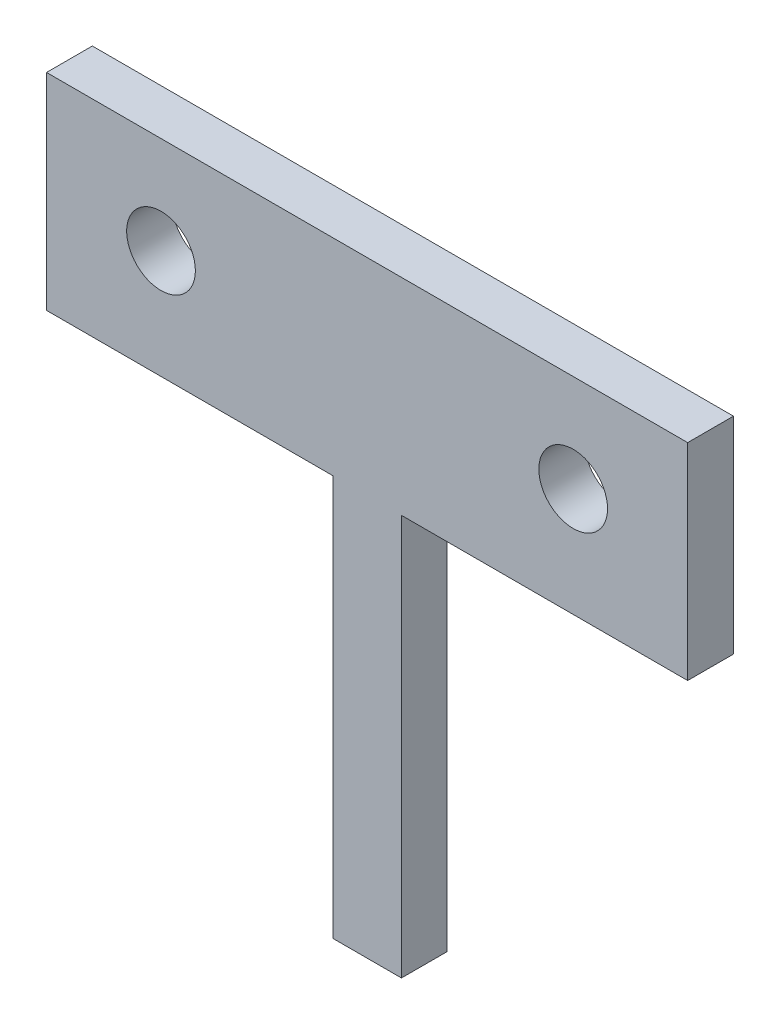
ISO-10303-21;
HEADER;
FILE_DESCRIPTION(('STEP AP214'),'2;1');
FILE_NAME('part.step','',(''),(''),'','','');
FILE_SCHEMA(('AUTOMOTIVE_DESIGN { 1 0 10303 214 1 1 1 1 }'));
ENDSEC;
DATA;
#1=APPLICATION_CONTEXT('core data for automotive mechanical design processes');
#2=APPLICATION_PROTOCOL_DEFINITION('international standard','automotive_design',2000,#1);
#3=PRODUCT_CONTEXT('',#1,'mechanical');
#4=PRODUCT('Part','Part','',(#3));
#5=PRODUCT_RELATED_PRODUCT_CATEGORY('part','',(#4));
#6=PRODUCT_DEFINITION_FORMATION('','',#4);
#7=PRODUCT_DEFINITION_CONTEXT('part definition',#1,'design');
#8=PRODUCT_DEFINITION('design','',#6,#7);
#9=PRODUCT_DEFINITION_SHAPE('','',#8);
#10=(LENGTH_UNIT() NAMED_UNIT(*) SI_UNIT(.MILLI.,.METRE.));
#11=(NAMED_UNIT(*) PLANE_ANGLE_UNIT() SI_UNIT($,.RADIAN.));
#12=(NAMED_UNIT(*) SI_UNIT($,.STERADIAN.) SOLID_ANGLE_UNIT());
#13=UNCERTAINTY_MEASURE_WITH_UNIT(LENGTH_MEASURE(1.E-05),#10,'distance_accuracy_value','');
#14=(GEOMETRIC_REPRESENTATION_CONTEXT(3) GLOBAL_UNCERTAINTY_ASSIGNED_CONTEXT((#13)) GLOBAL_UNIT_ASSIGNED_CONTEXT((#10,
#11,#12)) REPRESENTATION_CONTEXT('',''));
#15=CARTESIAN_POINT('',(0.,0.,0.));
#16=DIRECTION('',(0.,0.,1.));
#17=DIRECTION('',(1.,0.,0.));
#18=AXIS2_PLACEMENT_3D('',#15,#16,#17);
#19=CARTESIAN_POINT('',(0.,0.,2.));
#20=DIRECTION('',(0.,1.,0.));
#21=DIRECTION('',(0.,0.,1.));
#22=AXIS2_PLACEMENT_3D('',#19,#20,#21);
#23=PLANE('',#22);
#24=DIRECTION('',(1.,0.,0.));
#25=VECTOR('',#24,1.);
#26=CARTESIAN_POINT('',(0.,0.,0.));
#27=LINE('',#26,#25);
#28=CARTESIAN_POINT('',(0.,0.,0.));
#29=VERTEX_POINT('',#28);
#30=CARTESIAN_POINT('',(12.5,0.,0.));
#31=VERTEX_POINT('',#30);
#32=EDGE_CURVE('E144',#29,#31,#27,.T.);
#33=ORIENTED_EDGE('',*,*,#32,.T.);
#34=DIRECTION('',(0.,0.,-1.));
#35=VECTOR('',#34,1.);
#36=CARTESIAN_POINT('',(12.5,0.,2.));
#37=LINE('',#36,#35);
#38=CARTESIAN_POINT('',(12.5,0.,2.));
#39=VERTEX_POINT('',#38);
#40=EDGE_CURVE('E11',#39,#31,#37,.T.);
#41=ORIENTED_EDGE('',*,*,#40,.F.);
#42=DIRECTION('',(1.,0.,0.));
#43=VECTOR('',#42,1.);
#44=CARTESIAN_POINT('',(0.,0.,2.));
#45=LINE('',#44,#43);
#46=CARTESIAN_POINT('',(0.,0.,2.));
#47=VERTEX_POINT('',#46);
#48=EDGE_CURVE('E184',#47,#39,#45,.T.);
#49=ORIENTED_EDGE('',*,*,#48,.F.);
#50=DIRECTION('',(0.,0.,-1.));
#51=VECTOR('',#50,1.);
#52=CARTESIAN_POINT('',(0.,0.,2.));
#53=LINE('',#52,#51);
#54=EDGE_CURVE('E56',#47,#29,#53,.T.);
#55=ORIENTED_EDGE('',*,*,#54,.T.);
#56=EDGE_LOOP('',(#33,#41,#49,#55));
#57=FACE_BOUND('',#56,.T.);
#58=ADVANCED_FACE('F39',(#57),#23,.F.);
#59=CARTESIAN_POINT('',(12.5,0.,2.));
#60=DIRECTION('',(1.,0.,0.));
#61=DIRECTION('',(0.,0.,-1.));
#62=AXIS2_PLACEMENT_3D('',#59,#60,#61);
#63=PLANE('',#62);
#64=DIRECTION('',(0.,-1.,0.));
#65=VECTOR('',#64,1.);
#66=CARTESIAN_POINT('',(12.5,0.,0.));
#67=LINE('',#66,#65);
#68=CARTESIAN_POINT('',(12.5,-17.5,0.));
#69=VERTEX_POINT('',#68);
#70=EDGE_CURVE('E146',#31,#69,#67,.T.);
#71=ORIENTED_EDGE('',*,*,#70,.T.);
#72=DIRECTION('',(0.,0.,-1.));
#73=VECTOR('',#72,1.);
#74=CARTESIAN_POINT('',(12.5,-17.5,2.));
#75=LINE('',#74,#73);
#76=CARTESIAN_POINT('',(12.5,-17.5,2.));
#77=VERTEX_POINT('',#76);
#78=EDGE_CURVE('E48',#77,#69,#75,.T.);
#79=ORIENTED_EDGE('',*,*,#78,.F.);
#80=DIRECTION('',(0.,-1.,0.));
#81=VECTOR('',#80,1.);
#82=CARTESIAN_POINT('',(12.5,0.,2.));
#83=LINE('',#82,#81);
#84=EDGE_CURVE('E94',#39,#77,#83,.T.);
#85=ORIENTED_EDGE('',*,*,#84,.F.);
#86=ORIENTED_EDGE('',*,*,#40,.T.);
#87=EDGE_LOOP('',(#71,#79,#85,#86));
#88=FACE_BOUND('',#87,.T.);
#89=ADVANCED_FACE('F214',(#88),#63,.F.);
#90=CARTESIAN_POINT('',(0.,-17.5,2.));
#91=DIRECTION('',(0.,1.,0.));
#92=DIRECTION('',(0.,0.,1.));
#93=AXIS2_PLACEMENT_3D('',#90,#91,#92);
#94=PLANE('',#93);
#95=DIRECTION('',(1.,0.,0.));
#96=VECTOR('',#95,1.);
#97=CARTESIAN_POINT('',(0.,-17.5,0.));
#98=LINE('',#97,#96);
#99=CARTESIAN_POINT('',(15.5,-17.5,0.));
#100=VERTEX_POINT('',#99);
#101=EDGE_CURVE('E149',#69,#100,#98,.T.);
#102=ORIENTED_EDGE('',*,*,#101,.T.);
#103=DIRECTION('',(0.,0.,-1.));
#104=VECTOR('',#103,1.);
#105=CARTESIAN_POINT('',(15.5,-17.5,2.));
#106=LINE('',#105,#104);
#107=CARTESIAN_POINT('',(15.5,-17.5,2.));
#108=VERTEX_POINT('',#107);
#109=EDGE_CURVE('E167',#108,#100,#106,.T.);
#110=ORIENTED_EDGE('',*,*,#109,.F.);
#111=DIRECTION('',(1.,0.,0.));
#112=VECTOR('',#111,1.);
#113=CARTESIAN_POINT('',(0.,-17.5,2.));
#114=LINE('',#113,#112);
#115=EDGE_CURVE('E174',#77,#108,#114,.T.);
#116=ORIENTED_EDGE('',*,*,#115,.F.);
#117=ORIENTED_EDGE('',*,*,#78,.T.);
#118=EDGE_LOOP('',(#102,#110,#116,#117));
#119=FACE_BOUND('',#118,.T.);
#120=ADVANCED_FACE('F172',(#119),#94,.F.);
#121=CARTESIAN_POINT('',(15.5,0.,2.));
#122=DIRECTION('',(1.,0.,0.));
#123=DIRECTION('',(0.,1.,0.));
#124=AXIS2_PLACEMENT_3D('',#121,#122,#123);
#125=PLANE('',#124);
#126=DIRECTION('',(0.,-1.,0.));
#127=VECTOR('',#126,1.);
#128=CARTESIAN_POINT('',(15.5,0.,0.));
#129=LINE('',#128,#127);
#130=CARTESIAN_POINT('',(15.5,0.,0.));
#131=VERTEX_POINT('',#130);
#132=EDGE_CURVE('E152',#131,#100,#129,.T.);
#133=ORIENTED_EDGE('',*,*,#132,.F.);
#134=DIRECTION('',(0.,0.,-1.));
#135=VECTOR('',#134,1.);
#136=CARTESIAN_POINT('',(15.5,0.,2.));
#137=LINE('',#136,#135);
#138=CARTESIAN_POINT('',(15.5,0.,2.));
#139=VERTEX_POINT('',#138);
#140=EDGE_CURVE('E165',#139,#131,#137,.T.);
#141=ORIENTED_EDGE('',*,*,#140,.F.);
#142=DIRECTION('',(0.,-1.,0.));
#143=VECTOR('',#142,1.);
#144=CARTESIAN_POINT('',(15.5,0.,2.));
#145=LINE('',#144,#143);
#146=EDGE_CURVE('E182',#139,#108,#145,.T.);
#147=ORIENTED_EDGE('',*,*,#146,.T.);
#148=ORIENTED_EDGE('',*,*,#109,.T.);
#149=EDGE_LOOP('',(#133,#141,#147,#148));
#150=FACE_BOUND('',#149,.T.);
#151=ADVANCED_FACE('F180',(#150),#125,.T.);
#152=CARTESIAN_POINT('',(28.,0.,0.));
#153=VERTEX_POINT('',#152);
#154=EDGE_CURVE('E147',#131,#153,#27,.T.);
#155=ORIENTED_EDGE('',*,*,#154,.T.);
#156=DIRECTION('',(0.,0.,-1.));
#157=VECTOR('',#156,1.);
#158=CARTESIAN_POINT('',(28.,0.,2.));
#159=LINE('',#158,#157);
#160=CARTESIAN_POINT('',(28.,0.,2.));
#161=VERTEX_POINT('',#160);
#162=EDGE_CURVE('E130',#161,#153,#159,.T.);
#163=ORIENTED_EDGE('',*,*,#162,.F.);
#164=EDGE_CURVE('E118',#139,#161,#45,.T.);
#165=ORIENTED_EDGE('',*,*,#164,.F.);
#166=ORIENTED_EDGE('',*,*,#140,.T.);
#167=EDGE_LOOP('',(#155,#163,#165,#166));
#168=FACE_BOUND('',#167,.T.);
#169=ADVANCED_FACE('F216',(#168),#23,.F.);
#170=CARTESIAN_POINT('',(28.,0.,2.));
#171=DIRECTION('',(-1.,0.,0.));
#172=DIRECTION('',(0.,0.,1.));
#173=AXIS2_PLACEMENT_3D('',#170,#171,#172);
#174=PLANE('',#173);
#175=DIRECTION('',(0.,1.,0.));
#176=VECTOR('',#175,1.);
#177=CARTESIAN_POINT('',(28.,0.,0.));
#178=LINE('',#177,#176);
#179=CARTESIAN_POINT('',(28.,9.,0.));
#180=VERTEX_POINT('',#179);
#181=EDGE_CURVE('E127',#153,#180,#178,.T.);
#182=ORIENTED_EDGE('',*,*,#181,.T.);
#183=DIRECTION('',(0.,0.,-1.));
#184=VECTOR('',#183,1.);
#185=CARTESIAN_POINT('',(28.,9.,2.));
#186=LINE('',#185,#184);
#187=CARTESIAN_POINT('',(28.,9.,2.));
#188=VERTEX_POINT('',#187);
#189=EDGE_CURVE('E124',#188,#180,#186,.T.);
#190=ORIENTED_EDGE('',*,*,#189,.F.);
#191=DIRECTION('',(0.,1.,0.));
#192=VECTOR('',#191,1.);
#193=CARTESIAN_POINT('',(28.,0.,2.));
#194=LINE('',#193,#192);
#195=EDGE_CURVE('E110',#161,#188,#194,.T.);
#196=ORIENTED_EDGE('',*,*,#195,.F.);
#197=ORIENTED_EDGE('',*,*,#162,.T.);
#198=EDGE_LOOP('',(#182,#190,#196,#197));
#199=FACE_BOUND('',#198,.T.);
#200=ADVANCED_FACE('F125',(#199),#174,.F.);
#201=CARTESIAN_POINT('',(0.,9.,2.));
#202=DIRECTION('',(0.,1.,0.));
#203=DIRECTION('',(0.,0.,1.));
#204=AXIS2_PLACEMENT_3D('',#201,#202,#203);
#205=PLANE('',#204);
#206=DIRECTION('',(1.,0.,0.));
#207=VECTOR('',#206,1.);
#208=CARTESIAN_POINT('',(0.,9.,0.));
#209=LINE('',#208,#207);
#210=CARTESIAN_POINT('',(0.,9.,0.));
#211=VERTEX_POINT('',#210);
#212=EDGE_CURVE('E156',#211,#180,#209,.T.);
#213=ORIENTED_EDGE('',*,*,#212,.F.);
#214=DIRECTION('',(0.,0.,-1.));
#215=VECTOR('',#214,1.);
#216=CARTESIAN_POINT('',(0.,9.,2.));
#217=LINE('',#216,#215);
#218=CARTESIAN_POINT('',(0.,9.,2.));
#219=VERTEX_POINT('',#218);
#220=EDGE_CURVE('E82',#219,#211,#217,.T.);
#221=ORIENTED_EDGE('',*,*,#220,.F.);
#222=DIRECTION('',(1.,0.,0.));
#223=VECTOR('',#222,1.);
#224=CARTESIAN_POINT('',(0.,9.,2.));
#225=LINE('',#224,#223);
#226=EDGE_CURVE('E115',#219,#188,#225,.T.);
#227=ORIENTED_EDGE('',*,*,#226,.T.);
#228=ORIENTED_EDGE('',*,*,#189,.T.);
#229=EDGE_LOOP('',(#213,#221,#227,#228));
#230=FACE_BOUND('',#229,.T.);
#231=ADVANCED_FACE('F132',(#230),#205,.T.);
#232=CARTESIAN_POINT('',(5.,4.75,2.));
#233=DIRECTION('',(0.,0.,-1.));
#234=DIRECTION('',(-1.,0.,0.));
#235=AXIS2_PLACEMENT_3D('',#232,#233,#234);
#236=CYLINDRICAL_SURFACE('',#235,1.5);
#237=CARTESIAN_POINT('',(5.,4.75,2.));
#238=DIRECTION('',(0.,0.,1.));
#239=DIRECTION('',(1.,0.,0.));
#240=AXIS2_PLACEMENT_3D('',#237,#238,#239);
#241=CIRCLE('',#240,1.5);
#242=CARTESIAN_POINT('',(6.5,4.75,2.));
#243=VERTEX_POINT('',#242);
#244=EDGE_CURVE('E188',#243,#243,#241,.T.);
#245=ORIENTED_EDGE('',*,*,#244,.T.);
#246=EDGE_LOOP('',(#245));
#247=FACE_BOUND('',#246,.T.);
#248=CARTESIAN_POINT('',(5.,4.75,0.));
#249=DIRECTION('',(0.,0.,1.));
#250=DIRECTION('',(1.,0.,0.));
#251=AXIS2_PLACEMENT_3D('',#248,#249,#250);
#252=CIRCLE('',#251,1.5);
#253=CARTESIAN_POINT('',(6.5,4.75,0.));
#254=VERTEX_POINT('',#253);
#255=EDGE_CURVE('E141',#254,#254,#252,.T.);
#256=ORIENTED_EDGE('',*,*,#255,.F.);
#257=EDGE_LOOP('',(#256));
#258=FACE_BOUND('',#257,.T.);
#259=ADVANCED_FACE('F202',(#247,#258),#236,.F.);
#260=CARTESIAN_POINT('',(23.,4.75,2.));
#261=DIRECTION('',(0.,0.,-1.));
#262=DIRECTION('',(-1.,0.,0.));
#263=AXIS2_PLACEMENT_3D('',#260,#261,#262);
#264=CYLINDRICAL_SURFACE('',#263,1.5);
#265=CARTESIAN_POINT('',(23.,4.75,2.));
#266=DIRECTION('',(0.,0.,1.));
#267=DIRECTION('',(1.,0.,0.));
#268=AXIS2_PLACEMENT_3D('',#265,#266,#267);
#269=CIRCLE('',#268,1.5);
#270=CARTESIAN_POINT('',(24.5,4.75,2.));
#271=VERTEX_POINT('',#270);
#272=EDGE_CURVE('E161',#271,#271,#269,.T.);
#273=ORIENTED_EDGE('',*,*,#272,.T.);
#274=EDGE_LOOP('',(#273));
#275=FACE_BOUND('',#274,.T.);
#276=CARTESIAN_POINT('',(23.,4.75,0.));
#277=DIRECTION('',(0.,0.,1.));
#278=DIRECTION('',(1.,0.,0.));
#279=AXIS2_PLACEMENT_3D('',#276,#277,#278);
#280=CIRCLE('',#279,1.5);
#281=CARTESIAN_POINT('',(24.5,4.75,0.));
#282=VERTEX_POINT('',#281);
#283=EDGE_CURVE('E138',#282,#282,#280,.T.);
#284=ORIENTED_EDGE('',*,*,#283,.F.);
#285=EDGE_LOOP('',(#284));
#286=FACE_BOUND('',#285,.T.);
#287=ADVANCED_FACE('F41',(#275,#286),#264,.F.);
#288=CARTESIAN_POINT('',(0.,0.,2.));
#289=DIRECTION('',(-1.,0.,0.));
#290=DIRECTION('',(0.,0.,1.));
#291=AXIS2_PLACEMENT_3D('',#288,#289,#290);
#292=PLANE('',#291);
#293=DIRECTION('',(0.,1.,0.));
#294=VECTOR('',#293,1.);
#295=CARTESIAN_POINT('',(0.,0.,0.));
#296=LINE('',#295,#294);
#297=EDGE_CURVE('E158',#29,#211,#296,.T.);
#298=ORIENTED_EDGE('',*,*,#297,.F.);
#299=ORIENTED_EDGE('',*,*,#54,.F.);
#300=DIRECTION('',(0.,1.,0.));
#301=VECTOR('',#300,1.);
#302=CARTESIAN_POINT('',(0.,0.,2.));
#303=LINE('',#302,#301);
#304=EDGE_CURVE('E133',#47,#219,#303,.T.);
#305=ORIENTED_EDGE('',*,*,#304,.T.);
#306=ORIENTED_EDGE('',*,*,#220,.T.);
#307=EDGE_LOOP('',(#298,#299,#305,#306));
#308=FACE_BOUND('',#307,.T.);
#309=ADVANCED_FACE('F198',(#308),#292,.T.);
#310=CARTESIAN_POINT('',(0.,0.,2.));
#311=DIRECTION('',(0.,0.,1.));
#312=DIRECTION('',(1.,0.,0.));
#313=AXIS2_PLACEMENT_3D('',#310,#311,#312);
#314=PLANE('',#313);
#315=ORIENTED_EDGE('',*,*,#272,.F.);
#316=EDGE_LOOP('',(#315));
#317=FACE_BOUND('',#316,.T.);
#318=ORIENTED_EDGE('',*,*,#244,.F.);
#319=EDGE_LOOP('',(#318));
#320=FACE_BOUND('',#319,.T.);
#321=ORIENTED_EDGE('',*,*,#48,.T.);
#322=ORIENTED_EDGE('',*,*,#84,.T.);
#323=ORIENTED_EDGE('',*,*,#115,.T.);
#324=ORIENTED_EDGE('',*,*,#146,.F.);
#325=ORIENTED_EDGE('',*,*,#164,.T.);
#326=ORIENTED_EDGE('',*,*,#195,.T.);
#327=ORIENTED_EDGE('',*,*,#226,.F.);
#328=ORIENTED_EDGE('',*,*,#304,.F.);
#329=EDGE_LOOP('',(#321,#322,#323,#324,#325,#326,#327,#328));
#330=FACE_BOUND('',#329,.T.);
#331=ADVANCED_FACE('F112',(#317,#320,#330),#314,.T.);
#332=CARTESIAN_POINT('',(0.,0.,0.));
#333=DIRECTION('',(0.,0.,1.));
#334=DIRECTION('',(1.,0.,0.));
#335=AXIS2_PLACEMENT_3D('',#332,#333,#334);
#336=PLANE('',#335);
#337=ORIENTED_EDGE('',*,*,#283,.T.);
#338=EDGE_LOOP('',(#337));
#339=FACE_BOUND('',#338,.T.);
#340=ORIENTED_EDGE('',*,*,#255,.T.);
#341=EDGE_LOOP('',(#340));
#342=FACE_BOUND('',#341,.T.);
#343=ORIENTED_EDGE('',*,*,#32,.F.);
#344=ORIENTED_EDGE('',*,*,#297,.T.);
#345=ORIENTED_EDGE('',*,*,#212,.T.);
#346=ORIENTED_EDGE('',*,*,#181,.F.);
#347=ORIENTED_EDGE('',*,*,#154,.F.);
#348=ORIENTED_EDGE('',*,*,#132,.T.);
#349=ORIENTED_EDGE('',*,*,#101,.F.);
#350=ORIENTED_EDGE('',*,*,#70,.F.);
#351=EDGE_LOOP('',(#343,#344,#345,#346,#347,#348,#349,#350));
#352=FACE_BOUND('',#351,.T.);
#353=ADVANCED_FACE('F176',(#339,#342,#352),#336,.F.);
#354=CLOSED_SHELL('',(#58,#89,#120,#151,#169,#200,#231,#259,#287,#309,#331,#353));
#355=MANIFOLD_SOLID_BREP('B2',#354);
#356=ADVANCED_BREP_SHAPE_REPRESENTATION('',(#18,#355),#14);
#357=SHAPE_DEFINITION_REPRESENTATION(#9,#356);
ENDSEC;
END-ISO-10303-21;
